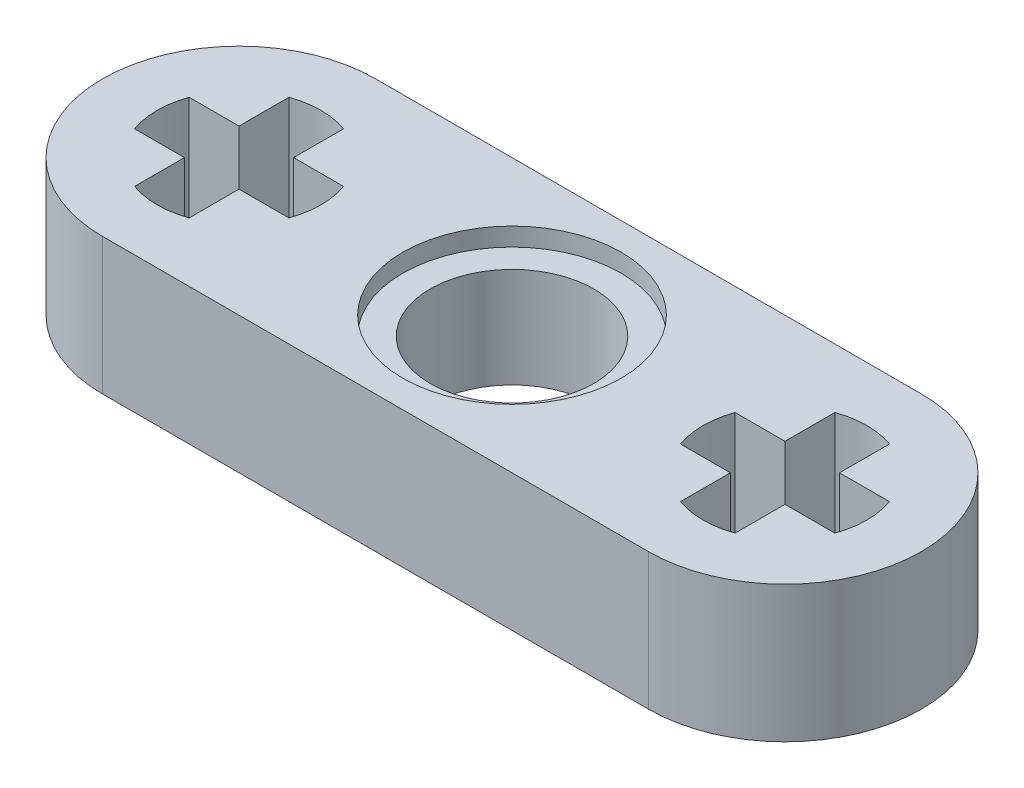
ISO-10303-21;
HEADER;
FILE_DESCRIPTION(('STEP AP214'),'2;1');
FILE_NAME('part.step','',(''),(''),'','','');
FILE_SCHEMA(('AUTOMOTIVE_DESIGN { 1 0 10303 214 1 1 1 1 }'));
ENDSEC;
DATA;
#1=APPLICATION_CONTEXT('core data for automotive mechanical design processes');
#2=APPLICATION_PROTOCOL_DEFINITION('international standard','automotive_design',2000,#1);
#3=PRODUCT_CONTEXT('',#1,'mechanical');
#4=PRODUCT('Part','Part','',(#3));
#5=PRODUCT_RELATED_PRODUCT_CATEGORY('part','',(#4));
#6=PRODUCT_DEFINITION_FORMATION('','',#4);
#7=PRODUCT_DEFINITION_CONTEXT('part definition',#1,'design');
#8=PRODUCT_DEFINITION('design','',#6,#7);
#9=PRODUCT_DEFINITION_SHAPE('','',#8);
#10=(LENGTH_UNIT() NAMED_UNIT(*) SI_UNIT(.MILLI.,.METRE.));
#11=(NAMED_UNIT(*) PLANE_ANGLE_UNIT() SI_UNIT($,.RADIAN.));
#12=(NAMED_UNIT(*) SI_UNIT($,.STERADIAN.) SOLID_ANGLE_UNIT());
#13=UNCERTAINTY_MEASURE_WITH_UNIT(LENGTH_MEASURE(1.E-05),#10,'distance_accuracy_value','');
#14=(GEOMETRIC_REPRESENTATION_CONTEXT(3) GLOBAL_UNCERTAINTY_ASSIGNED_CONTEXT((#13)) GLOBAL_UNIT_ASSIGNED_CONTEXT((#10,
#11,#12)) REPRESENTATION_CONTEXT('',''));
#15=CARTESIAN_POINT('',(0.,0.,0.));
#16=DIRECTION('',(0.,0.,1.));
#17=DIRECTION('',(1.,0.,0.));
#18=AXIS2_PLACEMENT_3D('',#15,#16,#17);
#19=CARTESIAN_POINT('',(5.,1.25,0.));
#20=DIRECTION('',(0.,-1.,0.));
#21=DIRECTION('',(0.,0.,-1.));
#22=AXIS2_PLACEMENT_3D('',#19,#20,#21);
#23=CYLINDRICAL_SURFACE('',#22,1.5);
#24=CARTESIAN_POINT('',(5.,0.,0.));
#25=DIRECTION('',(0.,1.,0.));
#26=DIRECTION('',(0.,0.,1.));
#27=AXIS2_PLACEMENT_3D('',#24,#25,#26);
#28=CIRCLE('',#27,1.5);
#29=CARTESIAN_POINT('',(4.5,0.,1.4142135623731));
#30=VERTEX_POINT('',#29);
#31=CARTESIAN_POINT('',(5.5,0.,1.4142135623731));
#32=VERTEX_POINT('',#31);
#33=EDGE_CURVE('E371',#30,#32,#28,.T.);
#34=ORIENTED_EDGE('',*,*,#33,.F.);
#35=DIRECTION('',(0.,-1.,0.));
#36=VECTOR('',#35,1.);
#37=CARTESIAN_POINT('',(4.5,1.25,1.4142135623731));
#38=LINE('',#37,#36);
#39=CARTESIAN_POINT('',(4.5,2.5,1.4142135623731));
#40=VERTEX_POINT('',#39);
#41=EDGE_CURVE('E11',#40,#30,#38,.T.);
#42=ORIENTED_EDGE('',*,*,#41,.F.);
#43=CARTESIAN_POINT('',(5.,2.5,0.));
#44=DIRECTION('',(0.,1.,0.));
#45=DIRECTION('',(0.,0.,1.));
#46=AXIS2_PLACEMENT_3D('',#43,#44,#45);
#47=CIRCLE('',#46,1.5);
#48=CARTESIAN_POINT('',(5.5,2.5,1.4142135623731));
#49=VERTEX_POINT('',#48);
#50=EDGE_CURVE('E291',#40,#49,#47,.T.);
#51=ORIENTED_EDGE('',*,*,#50,.T.);
#52=DIRECTION('',(0.,-1.,0.));
#53=VECTOR('',#52,1.);
#54=CARTESIAN_POINT('',(5.5,1.25,1.4142135623731));
#55=LINE('',#54,#53);
#56=EDGE_CURVE('E52',#49,#32,#55,.T.);
#57=ORIENTED_EDGE('',*,*,#56,.T.);
#58=EDGE_LOOP('',(#34,#42,#51,#57));
#59=FACE_BOUND('',#58,.T.);
#60=ADVANCED_FACE('F35',(#59),#23,.F.);
#61=CARTESIAN_POINT('',(4.5,1.25,0.));
#62=DIRECTION('',(-1.,0.,0.));
#63=DIRECTION('',(0.,0.,1.));
#64=AXIS2_PLACEMENT_3D('',#61,#62,#63);
#65=PLANE('',#64);
#66=DIRECTION('',(0.,0.,-1.));
#67=VECTOR('',#66,1.);
#68=CARTESIAN_POINT('',(4.5,0.,0.));
#69=LINE('',#68,#67);
#70=CARTESIAN_POINT('',(4.5,0.,0.5));
#71=VERTEX_POINT('',#70);
#72=EDGE_CURVE('E373',#30,#71,#69,.T.);
#73=ORIENTED_EDGE('',*,*,#72,.T.);
#74=DIRECTION('',(0.,-1.,0.));
#75=VECTOR('',#74,1.);
#76=CARTESIAN_POINT('',(4.5,1.25,0.5));
#77=LINE('',#76,#75);
#78=CARTESIAN_POINT('',(4.5,2.5,0.5));
#79=VERTEX_POINT('',#78);
#80=EDGE_CURVE('E44',#79,#71,#77,.T.);
#81=ORIENTED_EDGE('',*,*,#80,.F.);
#82=DIRECTION('',(0.,0.,-1.));
#83=VECTOR('',#82,1.);
#84=CARTESIAN_POINT('',(4.5,2.5,0.));
#85=LINE('',#84,#83);
#86=EDGE_CURVE('E316',#40,#79,#85,.T.);
#87=ORIENTED_EDGE('',*,*,#86,.F.);
#88=ORIENTED_EDGE('',*,*,#41,.T.);
#89=EDGE_LOOP('',(#73,#81,#87,#88));
#90=FACE_BOUND('',#89,.T.);
#91=ADVANCED_FACE('F496',(#90),#65,.F.);
#92=CARTESIAN_POINT('',(0.,1.25,0.5));
#93=DIRECTION('',(0.,0.,-1.));
#94=DIRECTION('',(-1.,0.,0.));
#95=AXIS2_PLACEMENT_3D('',#92,#93,#94);
#96=PLANE('',#95);
#97=DIRECTION('',(1.,0.,0.));
#98=VECTOR('',#97,1.);
#99=CARTESIAN_POINT('',(0.,0.,0.5));
#100=LINE('',#99,#98);
#101=CARTESIAN_POINT('',(3.58578643762691,0.,0.5));
#102=VERTEX_POINT('',#101);
#103=EDGE_CURVE('E378',#102,#71,#100,.T.);
#104=ORIENTED_EDGE('',*,*,#103,.F.);
#105=DIRECTION('',(0.,-1.,0.));
#106=VECTOR('',#105,1.);
#107=CARTESIAN_POINT('',(3.58578643762691,1.25,0.5));
#108=LINE('',#107,#106);
#109=CARTESIAN_POINT('',(3.58578643762691,2.5,0.5));
#110=VERTEX_POINT('',#109);
#111=EDGE_CURVE('E417',#110,#102,#108,.T.);
#112=ORIENTED_EDGE('',*,*,#111,.F.);
#113=DIRECTION('',(1.,0.,0.));
#114=VECTOR('',#113,1.);
#115=CARTESIAN_POINT('',(0.,2.5,0.5));
#116=LINE('',#115,#114);
#117=EDGE_CURVE('E313',#110,#79,#116,.T.);
#118=ORIENTED_EDGE('',*,*,#117,.T.);
#119=ORIENTED_EDGE('',*,*,#80,.T.);
#120=EDGE_LOOP('',(#104,#112,#118,#119));
#121=FACE_BOUND('',#120,.T.);
#122=ADVANCED_FACE('F503',(#121),#96,.T.);
#123=CARTESIAN_POINT('',(3.58578643762691,0.,-0.5));
#124=VERTEX_POINT('',#123);
#125=EDGE_CURVE('E375',#124,#102,#28,.T.);
#126=ORIENTED_EDGE('',*,*,#125,.F.);
#127=DIRECTION('',(0.,-1.,0.));
#128=VECTOR('',#127,1.);
#129=CARTESIAN_POINT('',(3.58578643762691,1.25,-0.5));
#130=LINE('',#129,#128);
#131=CARTESIAN_POINT('',(3.58578643762691,2.5,-0.5));
#132=VERTEX_POINT('',#131);
#133=EDGE_CURVE('E415',#132,#124,#130,.T.);
#134=ORIENTED_EDGE('',*,*,#133,.F.);
#135=EDGE_CURVE('E294',#132,#110,#47,.T.);
#136=ORIENTED_EDGE('',*,*,#135,.T.);
#137=ORIENTED_EDGE('',*,*,#111,.T.);
#138=EDGE_LOOP('',(#126,#134,#136,#137));
#139=FACE_BOUND('',#138,.T.);
#140=ADVANCED_FACE('F498',(#139),#23,.F.);
#141=CARTESIAN_POINT('',(0.,1.25,-0.5));
#142=DIRECTION('',(0.,0.,-1.));
#143=DIRECTION('',(-1.,0.,0.));
#144=AXIS2_PLACEMENT_3D('',#141,#142,#143);
#145=PLANE('',#144);
#146=DIRECTION('',(1.,0.,0.));
#147=VECTOR('',#146,1.);
#148=CARTESIAN_POINT('',(0.,0.,-0.5));
#149=LINE('',#148,#147);
#150=CARTESIAN_POINT('',(4.5,0.,-0.5));
#151=VERTEX_POINT('',#150);
#152=EDGE_CURVE('E381',#124,#151,#149,.T.);
#153=ORIENTED_EDGE('',*,*,#152,.T.);
#154=DIRECTION('',(0.,-1.,0.));
#155=VECTOR('',#154,1.);
#156=CARTESIAN_POINT('',(4.5,1.25,-0.5));
#157=LINE('',#156,#155);
#158=CARTESIAN_POINT('',(4.5,2.5,-0.5));
#159=VERTEX_POINT('',#158);
#160=EDGE_CURVE('E412',#159,#151,#157,.T.);
#161=ORIENTED_EDGE('',*,*,#160,.F.);
#162=DIRECTION('',(1.,0.,0.));
#163=VECTOR('',#162,1.);
#164=CARTESIAN_POINT('',(0.,2.5,-0.5));
#165=LINE('',#164,#163);
#166=EDGE_CURVE('E310',#132,#159,#165,.T.);
#167=ORIENTED_EDGE('',*,*,#166,.F.);
#168=ORIENTED_EDGE('',*,*,#133,.T.);
#169=EDGE_LOOP('',(#153,#161,#167,#168));
#170=FACE_BOUND('',#169,.T.);
#171=ADVANCED_FACE('F509',(#170),#145,.F.);
#172=CARTESIAN_POINT('',(4.5,1.25,0.));
#173=DIRECTION('',(-1.,0.,0.));
#174=DIRECTION('',(0.,0.,1.));
#175=AXIS2_PLACEMENT_3D('',#172,#173,#174);
#176=PLANE('',#175);
#177=DIRECTION('',(0.,0.,-1.));
#178=VECTOR('',#177,1.);
#179=CARTESIAN_POINT('',(4.5,0.,0.));
#180=LINE('',#179,#178);
#181=CARTESIAN_POINT('',(4.5,0.,-1.4142135623731));
#182=VERTEX_POINT('',#181);
#183=EDGE_CURVE('E384',#151,#182,#180,.T.);
#184=ORIENTED_EDGE('',*,*,#183,.T.);
#185=DIRECTION('',(0.,-1.,0.));
#186=VECTOR('',#185,1.);
#187=CARTESIAN_POINT('',(4.5,1.25,-1.4142135623731));
#188=LINE('',#187,#186);
#189=CARTESIAN_POINT('',(4.5,2.5,-1.4142135623731));
#190=VERTEX_POINT('',#189);
#191=EDGE_CURVE('E410',#190,#182,#188,.T.);
#192=ORIENTED_EDGE('',*,*,#191,.F.);
#193=DIRECTION('',(0.,0.,-1.));
#194=VECTOR('',#193,1.);
#195=CARTESIAN_POINT('',(4.5,2.5,0.));
#196=LINE('',#195,#194);
#197=EDGE_CURVE('E307',#159,#190,#196,.T.);
#198=ORIENTED_EDGE('',*,*,#197,.F.);
#199=ORIENTED_EDGE('',*,*,#160,.T.);
#200=EDGE_LOOP('',(#184,#192,#198,#199));
#201=FACE_BOUND('',#200,.T.);
#202=ADVANCED_FACE('F526',(#201),#176,.F.);
#203=CARTESIAN_POINT('',(5.5,0.,-1.4142135623731));
#204=VERTEX_POINT('',#203);
#205=EDGE_CURVE('E387',#204,#182,#28,.T.);
#206=ORIENTED_EDGE('',*,*,#205,.F.);
#207=DIRECTION('',(0.,-1.,0.));
#208=VECTOR('',#207,1.);
#209=CARTESIAN_POINT('',(5.5,1.25,-1.4142135623731));
#210=LINE('',#209,#208);
#211=CARTESIAN_POINT('',(5.5,2.5,-1.4142135623731));
#212=VERTEX_POINT('',#211);
#213=EDGE_CURVE('E408',#212,#204,#210,.T.);
#214=ORIENTED_EDGE('',*,*,#213,.F.);
#215=EDGE_CURVE('E306',#212,#190,#47,.T.);
#216=ORIENTED_EDGE('',*,*,#215,.T.);
#217=ORIENTED_EDGE('',*,*,#191,.T.);
#218=EDGE_LOOP('',(#206,#214,#216,#217));
#219=FACE_BOUND('',#218,.T.);
#220=ADVANCED_FACE('F511',(#219),#23,.F.);
#221=CARTESIAN_POINT('',(5.5,1.25,0.));
#222=DIRECTION('',(-1.,0.,0.));
#223=DIRECTION('',(0.,0.,1.));
#224=AXIS2_PLACEMENT_3D('',#221,#222,#223);
#225=PLANE('',#224);
#226=DIRECTION('',(0.,0.,-1.));
#227=VECTOR('',#226,1.);
#228=CARTESIAN_POINT('',(5.5,0.,0.));
#229=LINE('',#228,#227);
#230=CARTESIAN_POINT('',(5.5,0.,-0.5));
#231=VERTEX_POINT('',#230);
#232=EDGE_CURVE('E388',#231,#204,#229,.T.);
#233=ORIENTED_EDGE('',*,*,#232,.F.);
#234=DIRECTION('',(0.,-1.,0.));
#235=VECTOR('',#234,1.);
#236=CARTESIAN_POINT('',(5.5,1.25,-0.5));
#237=LINE('',#236,#235);
#238=CARTESIAN_POINT('',(5.5,2.5,-0.5));
#239=VERTEX_POINT('',#238);
#240=EDGE_CURVE('E406',#239,#231,#237,.T.);
#241=ORIENTED_EDGE('',*,*,#240,.F.);
#242=DIRECTION('',(0.,0.,-1.));
#243=VECTOR('',#242,1.);
#244=CARTESIAN_POINT('',(5.5,2.5,0.));
#245=LINE('',#244,#243);
#246=EDGE_CURVE('E303',#239,#212,#245,.T.);
#247=ORIENTED_EDGE('',*,*,#246,.T.);
#248=ORIENTED_EDGE('',*,*,#213,.T.);
#249=EDGE_LOOP('',(#233,#241,#247,#248));
#250=FACE_BOUND('',#249,.T.);
#251=ADVANCED_FACE('F522',(#250),#225,.T.);
#252=CARTESIAN_POINT('',(0.,1.25,-0.5));
#253=DIRECTION('',(0.,0.,-1.));
#254=DIRECTION('',(-1.,0.,0.));
#255=AXIS2_PLACEMENT_3D('',#252,#253,#254);
#256=PLANE('',#255);
#257=DIRECTION('',(1.,0.,0.));
#258=VECTOR('',#257,1.);
#259=CARTESIAN_POINT('',(0.,0.,-0.5));
#260=LINE('',#259,#258);
#261=CARTESIAN_POINT('',(6.4142135623731,0.,-0.5));
#262=VERTEX_POINT('',#261);
#263=EDGE_CURVE('E391',#231,#262,#260,.T.);
#264=ORIENTED_EDGE('',*,*,#263,.T.);
#265=DIRECTION('',(0.,-1.,0.));
#266=VECTOR('',#265,1.);
#267=CARTESIAN_POINT('',(6.4142135623731,1.25,-0.5));
#268=LINE('',#267,#266);
#269=CARTESIAN_POINT('',(6.4142135623731,2.5,-0.5));
#270=VERTEX_POINT('',#269);
#271=EDGE_CURVE('E404',#270,#262,#268,.T.);
#272=ORIENTED_EDGE('',*,*,#271,.F.);
#273=DIRECTION('',(1.,0.,0.));
#274=VECTOR('',#273,1.);
#275=CARTESIAN_POINT('',(0.,2.5,-0.5));
#276=LINE('',#275,#274);
#277=EDGE_CURVE('E300',#239,#270,#276,.T.);
#278=ORIENTED_EDGE('',*,*,#277,.F.);
#279=ORIENTED_EDGE('',*,*,#240,.T.);
#280=EDGE_LOOP('',(#264,#272,#278,#279));
#281=FACE_BOUND('',#280,.T.);
#282=ADVANCED_FACE('F514',(#281),#256,.F.);
#283=CARTESIAN_POINT('',(6.4142135623731,0.,0.5));
#284=VERTEX_POINT('',#283);
#285=EDGE_CURVE('E374',#284,#262,#28,.T.);
#286=ORIENTED_EDGE('',*,*,#285,.F.);
#287=DIRECTION('',(0.,-1.,0.));
#288=VECTOR('',#287,1.);
#289=CARTESIAN_POINT('',(6.4142135623731,1.25,0.5));
#290=LINE('',#289,#288);
#291=CARTESIAN_POINT('',(6.4142135623731,2.5,0.5));
#292=VERTEX_POINT('',#291);
#293=EDGE_CURVE('E402',#292,#284,#290,.T.);
#294=ORIENTED_EDGE('',*,*,#293,.F.);
#295=EDGE_CURVE('E295',#292,#270,#47,.T.);
#296=ORIENTED_EDGE('',*,*,#295,.T.);
#297=ORIENTED_EDGE('',*,*,#271,.T.);
#298=EDGE_LOOP('',(#286,#294,#296,#297));
#299=FACE_BOUND('',#298,.T.);
#300=ADVANCED_FACE('F499',(#299),#23,.F.);
#301=CARTESIAN_POINT('',(0.,1.25,0.5));
#302=DIRECTION('',(0.,0.,-1.));
#303=DIRECTION('',(-1.,0.,0.));
#304=AXIS2_PLACEMENT_3D('',#301,#302,#303);
#305=PLANE('',#304);
#306=DIRECTION('',(1.,0.,0.));
#307=VECTOR('',#306,1.);
#308=CARTESIAN_POINT('',(0.,0.,0.5));
#309=LINE('',#308,#307);
#310=CARTESIAN_POINT('',(5.5,0.,0.5));
#311=VERTEX_POINT('',#310);
#312=EDGE_CURVE('E394',#311,#284,#309,.T.);
#313=ORIENTED_EDGE('',*,*,#312,.F.);
#314=DIRECTION('',(0.,-1.,0.));
#315=VECTOR('',#314,1.);
#316=CARTESIAN_POINT('',(5.5,1.25,0.5));
#317=LINE('',#316,#315);
#318=CARTESIAN_POINT('',(5.5,2.5,0.5));
#319=VERTEX_POINT('',#318);
#320=EDGE_CURVE('E60',#319,#311,#317,.T.);
#321=ORIENTED_EDGE('',*,*,#320,.F.);
#322=DIRECTION('',(1.,0.,0.));
#323=VECTOR('',#322,1.);
#324=CARTESIAN_POINT('',(0.,2.5,0.5));
#325=LINE('',#324,#323);
#326=EDGE_CURVE('E297',#319,#292,#325,.T.);
#327=ORIENTED_EDGE('',*,*,#326,.T.);
#328=ORIENTED_EDGE('',*,*,#293,.T.);
#329=EDGE_LOOP('',(#313,#321,#327,#328));
#330=FACE_BOUND('',#329,.T.);
#331=ADVANCED_FACE('F513',(#330),#305,.T.);
#332=CARTESIAN_POINT('',(-5.,1.25,0.));
#333=DIRECTION('',(0.,-1.,0.));
#334=DIRECTION('',(0.,0.,-1.));
#335=AXIS2_PLACEMENT_3D('',#332,#333,#334);
#336=CYLINDRICAL_SURFACE('',#335,2.5);
#337=CARTESIAN_POINT('',(-5.,0.,0.));
#338=DIRECTION('',(0.,1.,0.));
#339=DIRECTION('',(0.,0.,1.));
#340=AXIS2_PLACEMENT_3D('',#337,#338,#339);
#341=CIRCLE('',#340,2.5);
#342=CARTESIAN_POINT('',(-5.,0.,-2.5));
#343=VERTEX_POINT('',#342);
#344=CARTESIAN_POINT('',(-5.,0.,2.5));
#345=VERTEX_POINT('',#344);
#346=EDGE_CURVE('E360',#343,#345,#341,.T.);
#347=ORIENTED_EDGE('',*,*,#346,.T.);
#348=DIRECTION('',(0.,-1.,0.));
#349=VECTOR('',#348,1.);
#350=CARTESIAN_POINT('',(-5.,1.25,2.5));
#351=LINE('',#350,#349);
#352=CARTESIAN_POINT('',(-5.,2.5,2.5));
#353=VERTEX_POINT('',#352);
#354=EDGE_CURVE('E400',#353,#345,#351,.T.);
#355=ORIENTED_EDGE('',*,*,#354,.F.);
#356=CARTESIAN_POINT('',(-5.,2.5,0.));
#357=DIRECTION('',(0.,1.,0.));
#358=DIRECTION('',(0.,0.,1.));
#359=AXIS2_PLACEMENT_3D('',#356,#357,#358);
#360=CIRCLE('',#359,2.5);
#361=CARTESIAN_POINT('',(-5.,2.5,-2.5));
#362=VERTEX_POINT('',#361);
#363=EDGE_CURVE('E279',#362,#353,#360,.T.);
#364=ORIENTED_EDGE('',*,*,#363,.F.);
#365=DIRECTION('',(0.,-1.,0.));
#366=VECTOR('',#365,1.);
#367=CARTESIAN_POINT('',(-5.,1.25,-2.5));
#368=LINE('',#367,#366);
#369=EDGE_CURVE('E420',#362,#343,#368,.T.);
#370=ORIENTED_EDGE('',*,*,#369,.T.);
#371=EDGE_LOOP('',(#347,#355,#364,#370));
#372=FACE_BOUND('',#371,.T.);
#373=ADVANCED_FACE('F520',(#372),#336,.T.);
#374=CARTESIAN_POINT('',(0.,1.25,2.5));
#375=DIRECTION('',(0.,0.,-1.));
#376=DIRECTION('',(-1.,0.,0.));
#377=AXIS2_PLACEMENT_3D('',#374,#375,#376);
#378=PLANE('',#377);
#379=DIRECTION('',(1.,0.,0.));
#380=VECTOR('',#379,1.);
#381=CARTESIAN_POINT('',(0.,0.,2.5));
#382=LINE('',#381,#380);
#383=CARTESIAN_POINT('',(5.,0.,2.5));
#384=VERTEX_POINT('',#383);
#385=EDGE_CURVE('E363',#345,#384,#382,.T.);
#386=ORIENTED_EDGE('',*,*,#385,.T.);
#387=DIRECTION('',(0.,-1.,0.));
#388=VECTOR('',#387,1.);
#389=CARTESIAN_POINT('',(5.,1.25,2.5));
#390=LINE('',#389,#388);
#391=CARTESIAN_POINT('',(5.,2.5,2.5));
#392=VERTEX_POINT('',#391);
#393=EDGE_CURVE('E424',#392,#384,#390,.T.);
#394=ORIENTED_EDGE('',*,*,#393,.F.);
#395=DIRECTION('',(1.,0.,0.));
#396=VECTOR('',#395,1.);
#397=CARTESIAN_POINT('',(0.,2.5,2.5));
#398=LINE('',#397,#396);
#399=EDGE_CURVE('E288',#353,#392,#398,.T.);
#400=ORIENTED_EDGE('',*,*,#399,.F.);
#401=ORIENTED_EDGE('',*,*,#354,.T.);
#402=EDGE_LOOP('',(#386,#394,#400,#401));
#403=FACE_BOUND('',#402,.T.);
#404=ADVANCED_FACE('F580',(#403),#378,.F.);
#405=CARTESIAN_POINT('',(5.,1.25,0.));
#406=DIRECTION('',(0.,-1.,0.));
#407=DIRECTION('',(0.,0.,-1.));
#408=AXIS2_PLACEMENT_3D('',#405,#406,#407);
#409=CYLINDRICAL_SURFACE('',#408,2.5);
#410=CARTESIAN_POINT('',(5.,0.,0.));
#411=DIRECTION('',(0.,1.,0.));
#412=DIRECTION('',(0.,0.,1.));
#413=AXIS2_PLACEMENT_3D('',#410,#411,#412);
#414=CIRCLE('',#413,2.5);
#415=CARTESIAN_POINT('',(5.,0.,-2.5));
#416=VERTEX_POINT('',#415);
#417=EDGE_CURVE('E365',#384,#416,#414,.T.);
#418=ORIENTED_EDGE('',*,*,#417,.T.);
#419=DIRECTION('',(0.,-1.,0.));
#420=VECTOR('',#419,1.);
#421=CARTESIAN_POINT('',(5.,1.25,-2.5));
#422=LINE('',#421,#420);
#423=CARTESIAN_POINT('',(5.,2.5,-2.5));
#424=VERTEX_POINT('',#423);
#425=EDGE_CURVE('E422',#424,#416,#422,.T.);
#426=ORIENTED_EDGE('',*,*,#425,.F.);
#427=CARTESIAN_POINT('',(5.,2.5,0.));
#428=DIRECTION('',(0.,1.,0.));
#429=DIRECTION('',(0.,0.,1.));
#430=AXIS2_PLACEMENT_3D('',#427,#428,#429);
#431=CIRCLE('',#430,2.5);
#432=EDGE_CURVE('E285',#392,#424,#431,.T.);
#433=ORIENTED_EDGE('',*,*,#432,.F.);
#434=ORIENTED_EDGE('',*,*,#393,.T.);
#435=EDGE_LOOP('',(#418,#426,#433,#434));
#436=FACE_BOUND('',#435,.T.);
#437=ADVANCED_FACE('F577',(#436),#409,.T.);
#438=CARTESIAN_POINT('',(-5.,1.25,0.));
#439=DIRECTION('',(0.,-1.,0.));
#440=DIRECTION('',(0.,0.,-1.));
#441=AXIS2_PLACEMENT_3D('',#438,#439,#440);
#442=CYLINDRICAL_SURFACE('',#441,1.5);
#443=CARTESIAN_POINT('',(-5.,0.,0.));
#444=DIRECTION('',(0.,1.,0.));
#445=DIRECTION('',(0.,0.,1.));
#446=AXIS2_PLACEMENT_3D('',#443,#444,#445);
#447=CIRCLE('',#446,1.5);
#448=CARTESIAN_POINT('',(-3.5857864376269,0.,0.5));
#449=VERTEX_POINT('',#448);
#450=CARTESIAN_POINT('',(-3.5857864376269,0.,-0.5));
#451=VERTEX_POINT('',#450);
#452=EDGE_CURVE('E326',#449,#451,#447,.T.);
#453=ORIENTED_EDGE('',*,*,#452,.F.);
#454=DIRECTION('',(0.,-1.,0.));
#455=VECTOR('',#454,1.);
#456=CARTESIAN_POINT('',(-3.5857864376269,1.25,0.5));
#457=LINE('',#456,#455);
#458=CARTESIAN_POINT('',(-3.5857864376269,2.5,0.5));
#459=VERTEX_POINT('',#458);
#460=EDGE_CURVE('E39',#459,#449,#457,.T.);
#461=ORIENTED_EDGE('',*,*,#460,.F.);
#462=CARTESIAN_POINT('',(-5.,2.5,0.));
#463=DIRECTION('',(0.,1.,0.));
#464=DIRECTION('',(0.,0.,1.));
#465=AXIS2_PLACEMENT_3D('',#462,#463,#464);
#466=CIRCLE('',#465,1.5);
#467=CARTESIAN_POINT('',(-3.5857864376269,2.5,-0.5));
#468=VERTEX_POINT('',#467);
#469=EDGE_CURVE('E237',#459,#468,#466,.T.);
#470=ORIENTED_EDGE('',*,*,#469,.T.);
#471=DIRECTION('',(0.,-1.,0.));
#472=VECTOR('',#471,1.);
#473=CARTESIAN_POINT('',(-3.5857864376269,1.25,-0.5));
#474=LINE('',#473,#472);
#475=EDGE_CURVE('E223',#468,#451,#474,.T.);
#476=ORIENTED_EDGE('',*,*,#475,.T.);
#477=EDGE_LOOP('',(#453,#461,#470,#476));
#478=FACE_BOUND('',#477,.T.);
#479=ADVANCED_FACE('F37',(#478),#442,.F.);
#480=CARTESIAN_POINT('',(0.,1.25,0.5));
#481=DIRECTION('',(0.,0.,-1.));
#482=DIRECTION('',(-1.,0.,0.));
#483=AXIS2_PLACEMENT_3D('',#480,#481,#482);
#484=PLANE('',#483);
#485=DIRECTION('',(1.,0.,0.));
#486=VECTOR('',#485,1.);
#487=CARTESIAN_POINT('',(0.,0.,0.5));
#488=LINE('',#487,#486);
#489=CARTESIAN_POINT('',(-4.5,0.,0.5));
#490=VERTEX_POINT('',#489);
#491=EDGE_CURVE('E330',#490,#449,#488,.T.);
#492=ORIENTED_EDGE('',*,*,#491,.F.);
#493=DIRECTION('',(0.,-1.,0.));
#494=VECTOR('',#493,1.);
#495=CARTESIAN_POINT('',(-4.5,1.25,0.5));
#496=LINE('',#495,#494);
#497=CARTESIAN_POINT('',(-4.5,2.5,0.5));
#498=VERTEX_POINT('',#497);
#499=EDGE_CURVE('E446',#498,#490,#496,.T.);
#500=ORIENTED_EDGE('',*,*,#499,.F.);
#501=DIRECTION('',(1.,0.,0.));
#502=VECTOR('',#501,1.);
#503=CARTESIAN_POINT('',(0.,2.5,0.5));
#504=LINE('',#503,#502);
#505=EDGE_CURVE('E277',#498,#459,#504,.T.);
#506=ORIENTED_EDGE('',*,*,#505,.T.);
#507=ORIENTED_EDGE('',*,*,#460,.T.);
#508=EDGE_LOOP('',(#492,#500,#506,#507));
#509=FACE_BOUND('',#508,.T.);
#510=ADVANCED_FACE('F451',(#509),#484,.T.);
#511=CARTESIAN_POINT('',(-4.5,1.25,0.));
#512=DIRECTION('',(-1.,0.,0.));
#513=DIRECTION('',(0.,0.,1.));
#514=AXIS2_PLACEMENT_3D('',#511,#512,#513);
#515=PLANE('',#514);
#516=DIRECTION('',(0.,0.,-1.));
#517=VECTOR('',#516,1.);
#518=CARTESIAN_POINT('',(-4.5,0.,0.));
#519=LINE('',#518,#517);
#520=CARTESIAN_POINT('',(-4.5,0.,1.4142135623731));
#521=VERTEX_POINT('',#520);
#522=EDGE_CURVE('E333',#521,#490,#519,.T.);
#523=ORIENTED_EDGE('',*,*,#522,.F.);
#524=DIRECTION('',(0.,-1.,0.));
#525=VECTOR('',#524,1.);
#526=CARTESIAN_POINT('',(-4.5,1.25,1.4142135623731));
#527=LINE('',#526,#525);
#528=CARTESIAN_POINT('',(-4.5,2.5,1.4142135623731));
#529=VERTEX_POINT('',#528);
#530=EDGE_CURVE('E445',#529,#521,#527,.T.);
#531=ORIENTED_EDGE('',*,*,#530,.F.);
#532=DIRECTION('',(0.,0.,-1.));
#533=VECTOR('',#532,1.);
#534=CARTESIAN_POINT('',(-4.5,2.5,0.));
#535=LINE('',#534,#533);
#536=EDGE_CURVE('E274',#529,#498,#535,.T.);
#537=ORIENTED_EDGE('',*,*,#536,.T.);
#538=ORIENTED_EDGE('',*,*,#499,.T.);
#539=EDGE_LOOP('',(#523,#531,#537,#538));
#540=FACE_BOUND('',#539,.T.);
#541=ADVANCED_FACE('F457',(#540),#515,.T.);
#542=CARTESIAN_POINT('',(-5.,1.25,0.));
#543=DIRECTION('',(0.,-1.,0.));
#544=DIRECTION('',(0.,0.,-1.));
#545=AXIS2_PLACEMENT_3D('',#542,#543,#544);
#546=CYLINDRICAL_SURFACE('',#545,1.5);
#547=CARTESIAN_POINT('',(-5.,0.,0.));
#548=DIRECTION('',(0.,1.,0.));
#549=DIRECTION('',(0.,0.,1.));
#550=AXIS2_PLACEMENT_3D('',#547,#548,#549);
#551=CIRCLE('',#550,1.5);
#552=CARTESIAN_POINT('',(-5.5,0.,1.4142135623731));
#553=VERTEX_POINT('',#552);
#554=EDGE_CURVE('E336',#553,#521,#551,.T.);
#555=ORIENTED_EDGE('',*,*,#554,.F.);
#556=DIRECTION('',(0.,-1.,0.));
#557=VECTOR('',#556,1.);
#558=CARTESIAN_POINT('',(-5.5,1.25,1.4142135623731));
#559=LINE('',#558,#557);
#560=CARTESIAN_POINT('',(-5.5,2.5,1.4142135623731));
#561=VERTEX_POINT('',#560);
#562=EDGE_CURVE('E443',#561,#553,#559,.T.);
#563=ORIENTED_EDGE('',*,*,#562,.F.);
#564=CARTESIAN_POINT('',(-5.,2.5,0.));
#565=DIRECTION('',(0.,1.,0.));
#566=DIRECTION('',(0.,0.,1.));
#567=AXIS2_PLACEMENT_3D('',#564,#565,#566);
#568=CIRCLE('',#567,1.5);
#569=EDGE_CURVE('E271',#561,#529,#568,.T.);
#570=ORIENTED_EDGE('',*,*,#569,.T.);
#571=ORIENTED_EDGE('',*,*,#530,.T.);
#572=EDGE_LOOP('',(#555,#563,#570,#571));
#573=FACE_BOUND('',#572,.T.);
#574=ADVANCED_FACE('F461',(#573),#546,.F.);
#575=CARTESIAN_POINT('',(-5.5,1.25,0.));
#576=DIRECTION('',(-1.,0.,0.));
#577=DIRECTION('',(0.,0.,1.));
#578=AXIS2_PLACEMENT_3D('',#575,#576,#577);
#579=PLANE('',#578);
#580=DIRECTION('',(0.,0.,-1.));
#581=VECTOR('',#580,1.);
#582=CARTESIAN_POINT('',(-5.5,0.,0.));
#583=LINE('',#582,#581);
#584=CARTESIAN_POINT('',(-5.5,0.,0.5));
#585=VERTEX_POINT('',#584);
#586=EDGE_CURVE('E339',#553,#585,#583,.T.);
#587=ORIENTED_EDGE('',*,*,#586,.T.);
#588=DIRECTION('',(0.,-1.,0.));
#589=VECTOR('',#588,1.);
#590=CARTESIAN_POINT('',(-5.5,1.25,0.5));
#591=LINE('',#590,#589);
#592=CARTESIAN_POINT('',(-5.5,2.5,0.5));
#593=VERTEX_POINT('',#592);
#594=EDGE_CURVE('E441',#593,#585,#591,.T.);
#595=ORIENTED_EDGE('',*,*,#594,.F.);
#596=DIRECTION('',(0.,0.,-1.));
#597=VECTOR('',#596,1.);
#598=CARTESIAN_POINT('',(-5.5,2.5,0.));
#599=LINE('',#598,#597);
#600=EDGE_CURVE('E268',#561,#593,#599,.T.);
#601=ORIENTED_EDGE('',*,*,#600,.F.);
#602=ORIENTED_EDGE('',*,*,#562,.T.);
#603=EDGE_LOOP('',(#587,#595,#601,#602));
#604=FACE_BOUND('',#603,.T.);
#605=ADVANCED_FACE('F465',(#604),#579,.F.);
#606=CARTESIAN_POINT('',(0.,1.25,0.5));
#607=DIRECTION('',(0.,0.,-1.));
#608=DIRECTION('',(-1.,0.,0.));
#609=AXIS2_PLACEMENT_3D('',#606,#607,#608);
#610=PLANE('',#609);
#611=DIRECTION('',(1.,0.,0.));
#612=VECTOR('',#611,1.);
#613=CARTESIAN_POINT('',(0.,0.,0.5));
#614=LINE('',#613,#612);
#615=CARTESIAN_POINT('',(-6.41421356237309,0.,0.5));
#616=VERTEX_POINT('',#615);
#617=EDGE_CURVE('E342',#616,#585,#614,.T.);
#618=ORIENTED_EDGE('',*,*,#617,.F.);
#619=DIRECTION('',(0.,-1.,0.));
#620=VECTOR('',#619,1.);
#621=CARTESIAN_POINT('',(-6.41421356237309,1.25,0.5));
#622=LINE('',#621,#620);
#623=CARTESIAN_POINT('',(-6.41421356237309,2.5,0.5));
#624=VERTEX_POINT('',#623);
#625=EDGE_CURVE('E439',#624,#616,#622,.T.);
#626=ORIENTED_EDGE('',*,*,#625,.F.);
#627=DIRECTION('',(1.,0.,0.));
#628=VECTOR('',#627,1.);
#629=CARTESIAN_POINT('',(0.,2.5,0.5));
#630=LINE('',#629,#628);
#631=EDGE_CURVE('E265',#624,#593,#630,.T.);
#632=ORIENTED_EDGE('',*,*,#631,.T.);
#633=ORIENTED_EDGE('',*,*,#594,.T.);
#634=EDGE_LOOP('',(#618,#626,#632,#633));
#635=FACE_BOUND('',#634,.T.);
#636=ADVANCED_FACE('F468',(#635),#610,.T.);
#637=CARTESIAN_POINT('',(-5.,1.25,0.));
#638=DIRECTION('',(0.,-1.,0.));
#639=DIRECTION('',(0.,0.,-1.));
#640=AXIS2_PLACEMENT_3D('',#637,#638,#639);
#641=CYLINDRICAL_SURFACE('',#640,1.5);
#642=CARTESIAN_POINT('',(-5.,0.,0.));
#643=DIRECTION('',(0.,1.,0.));
#644=DIRECTION('',(0.,0.,1.));
#645=AXIS2_PLACEMENT_3D('',#642,#643,#644);
#646=CIRCLE('',#645,1.5);
#647=CARTESIAN_POINT('',(-6.41421356237309,0.,-0.5));
#648=VERTEX_POINT('',#647);
#649=EDGE_CURVE('E345',#648,#616,#646,.T.);
#650=ORIENTED_EDGE('',*,*,#649,.F.);
#651=DIRECTION('',(0.,-1.,0.));
#652=VECTOR('',#651,1.);
#653=CARTESIAN_POINT('',(-6.41421356237309,1.25,-0.5));
#654=LINE('',#653,#652);
#655=CARTESIAN_POINT('',(-6.41421356237309,2.5,-0.5));
#656=VERTEX_POINT('',#655);
#657=EDGE_CURVE('E437',#656,#648,#654,.T.);
#658=ORIENTED_EDGE('',*,*,#657,.F.);
#659=CARTESIAN_POINT('',(-5.,2.5,0.));
#660=DIRECTION('',(0.,1.,0.));
#661=DIRECTION('',(0.,0.,1.));
#662=AXIS2_PLACEMENT_3D('',#659,#660,#661);
#663=CIRCLE('',#662,1.5);
#664=EDGE_CURVE('E262',#656,#624,#663,.T.);
#665=ORIENTED_EDGE('',*,*,#664,.T.);
#666=ORIENTED_EDGE('',*,*,#625,.T.);
#667=EDGE_LOOP('',(#650,#658,#665,#666));
#668=FACE_BOUND('',#667,.T.);
#669=ADVANCED_FACE('F486',(#668),#641,.F.);
#670=CARTESIAN_POINT('',(0.,1.25,-0.5));
#671=DIRECTION('',(0.,0.,-1.));
#672=DIRECTION('',(-1.,0.,0.));
#673=AXIS2_PLACEMENT_3D('',#670,#671,#672);
#674=PLANE('',#673);
#675=DIRECTION('',(1.,0.,0.));
#676=VECTOR('',#675,1.);
#677=CARTESIAN_POINT('',(0.,0.,-0.5));
#678=LINE('',#677,#676);
#679=CARTESIAN_POINT('',(-5.5,0.,-0.5));
#680=VERTEX_POINT('',#679);
#681=EDGE_CURVE('E348',#648,#680,#678,.T.);
#682=ORIENTED_EDGE('',*,*,#681,.T.);
#683=DIRECTION('',(0.,-1.,0.));
#684=VECTOR('',#683,1.);
#685=CARTESIAN_POINT('',(-5.5,1.25,-0.5));
#686=LINE('',#685,#684);
#687=CARTESIAN_POINT('',(-5.5,2.5,-0.5));
#688=VERTEX_POINT('',#687);
#689=EDGE_CURVE('E434',#688,#680,#686,.T.);
#690=ORIENTED_EDGE('',*,*,#689,.F.);
#691=DIRECTION('',(1.,0.,0.));
#692=VECTOR('',#691,1.);
#693=CARTESIAN_POINT('',(0.,2.5,-0.5));
#694=LINE('',#693,#692);
#695=EDGE_CURVE('E259',#656,#688,#694,.T.);
#696=ORIENTED_EDGE('',*,*,#695,.F.);
#697=ORIENTED_EDGE('',*,*,#657,.T.);
#698=EDGE_LOOP('',(#682,#690,#696,#697));
#699=FACE_BOUND('',#698,.T.);
#700=ADVANCED_FACE('F473',(#699),#674,.F.);
#701=CARTESIAN_POINT('',(-5.5,1.25,0.));
#702=DIRECTION('',(-1.,0.,0.));
#703=DIRECTION('',(0.,0.,1.));
#704=AXIS2_PLACEMENT_3D('',#701,#702,#703);
#705=PLANE('',#704);
#706=DIRECTION('',(0.,0.,-1.));
#707=VECTOR('',#706,1.);
#708=CARTESIAN_POINT('',(-5.5,0.,0.));
#709=LINE('',#708,#707);
#710=CARTESIAN_POINT('',(-5.5,0.,-1.4142135623731));
#711=VERTEX_POINT('',#710);
#712=EDGE_CURVE('E350',#680,#711,#709,.T.);
#713=ORIENTED_EDGE('',*,*,#712,.T.);
#714=DIRECTION('',(0.,-1.,0.));
#715=VECTOR('',#714,1.);
#716=CARTESIAN_POINT('',(-5.5,1.25,-1.4142135623731));
#717=LINE('',#716,#715);
#718=CARTESIAN_POINT('',(-5.5,2.5,-1.4142135623731));
#719=VERTEX_POINT('',#718);
#720=EDGE_CURVE('E432',#719,#711,#717,.T.);
#721=ORIENTED_EDGE('',*,*,#720,.F.);
#722=DIRECTION('',(0.,0.,-1.));
#723=VECTOR('',#722,1.);
#724=CARTESIAN_POINT('',(-5.5,2.5,0.));
#725=LINE('',#724,#723);
#726=EDGE_CURVE('E256',#688,#719,#725,.T.);
#727=ORIENTED_EDGE('',*,*,#726,.F.);
#728=ORIENTED_EDGE('',*,*,#689,.T.);
#729=EDGE_LOOP('',(#713,#721,#727,#728));
#730=FACE_BOUND('',#729,.T.);
#731=ADVANCED_FACE('F478',(#730),#705,.F.);
#732=CARTESIAN_POINT('',(-5.,1.25,0.));
#733=DIRECTION('',(0.,-1.,0.));
#734=DIRECTION('',(0.,0.,-1.));
#735=AXIS2_PLACEMENT_3D('',#732,#733,#734);
#736=CYLINDRICAL_SURFACE('',#735,1.5);
#737=CARTESIAN_POINT('',(-5.,0.,0.));
#738=DIRECTION('',(0.,1.,0.));
#739=DIRECTION('',(0.,0.,1.));
#740=AXIS2_PLACEMENT_3D('',#737,#738,#739);
#741=CIRCLE('',#740,1.5);
#742=CARTESIAN_POINT('',(-4.5,0.,-1.4142135623731));
#743=VERTEX_POINT('',#742);
#744=EDGE_CURVE('E353',#743,#711,#741,.T.);
#745=ORIENTED_EDGE('',*,*,#744,.F.);
#746=DIRECTION('',(0.,-1.,0.));
#747=VECTOR('',#746,1.);
#748=CARTESIAN_POINT('',(-4.5,1.25,-1.4142135623731));
#749=LINE('',#748,#747);
#750=CARTESIAN_POINT('',(-4.5,2.5,-1.4142135623731));
#751=VERTEX_POINT('',#750);
#752=EDGE_CURVE('E430',#751,#743,#749,.T.);
#753=ORIENTED_EDGE('',*,*,#752,.F.);
#754=CARTESIAN_POINT('',(-5.,2.5,0.));
#755=DIRECTION('',(0.,1.,0.));
#756=DIRECTION('',(0.,0.,1.));
#757=AXIS2_PLACEMENT_3D('',#754,#755,#756);
#758=CIRCLE('',#757,1.5);
#759=EDGE_CURVE('E250',#751,#719,#758,.T.);
#760=ORIENTED_EDGE('',*,*,#759,.T.);
#761=ORIENTED_EDGE('',*,*,#720,.T.);
#762=EDGE_LOOP('',(#745,#753,#760,#761));
#763=FACE_BOUND('',#762,.T.);
#764=ADVANCED_FACE('F481',(#763),#736,.F.);
#765=CARTESIAN_POINT('',(-4.5,1.25,0.));
#766=DIRECTION('',(-1.,0.,0.));
#767=DIRECTION('',(0.,0.,1.));
#768=AXIS2_PLACEMENT_3D('',#765,#766,#767);
#769=PLANE('',#768);
#770=DIRECTION('',(0.,0.,-1.));
#771=VECTOR('',#770,1.);
#772=CARTESIAN_POINT('',(-4.5,0.,0.));
#773=LINE('',#772,#771);
#774=CARTESIAN_POINT('',(-4.5,0.,-0.5));
#775=VERTEX_POINT('',#774);
#776=EDGE_CURVE('E356',#775,#743,#773,.T.);
#777=ORIENTED_EDGE('',*,*,#776,.F.);
#778=DIRECTION('',(0.,-1.,0.));
#779=VECTOR('',#778,1.);
#780=CARTESIAN_POINT('',(-4.5,1.25,-0.5));
#781=LINE('',#780,#779);
#782=CARTESIAN_POINT('',(-4.5,2.5,-0.5));
#783=VERTEX_POINT('',#782);
#784=EDGE_CURVE('E233',#783,#775,#781,.T.);
#785=ORIENTED_EDGE('',*,*,#784,.F.);
#786=DIRECTION('',(0.,0.,-1.));
#787=VECTOR('',#786,1.);
#788=CARTESIAN_POINT('',(-4.5,2.5,0.));
#789=LINE('',#788,#787);
#790=EDGE_CURVE('E248',#783,#751,#789,.T.);
#791=ORIENTED_EDGE('',*,*,#790,.T.);
#792=ORIENTED_EDGE('',*,*,#752,.T.);
#793=EDGE_LOOP('',(#777,#785,#791,#792));
#794=FACE_BOUND('',#793,.T.);
#795=ADVANCED_FACE('F484',(#794),#769,.T.);
#796=CARTESIAN_POINT('',(0.,1.25,0.));
#797=DIRECTION('',(0.,-1.,0.));
#798=DIRECTION('',(0.,0.,-1.));
#799=AXIS2_PLACEMENT_3D('',#796,#797,#798);
#800=CYLINDRICAL_SURFACE('',#799,1.5);
#801=CARTESIAN_POINT('',(0.,2.16666666666667,0.));
#802=DIRECTION('',(0.,1.,0.));
#803=DIRECTION('',(0.,0.,1.));
#804=AXIS2_PLACEMENT_3D('',#801,#802,#803);
#805=CIRCLE('',#804,1.5);
#806=CARTESIAN_POINT('',(0.,2.16666666666667,1.5));
#807=VERTEX_POINT('',#806);
#808=EDGE_CURVE('E1050',#807,#807,#805,.T.);
#809=ORIENTED_EDGE('',*,*,#808,.T.);
#810=EDGE_LOOP('',(#809));
#811=FACE_BOUND('',#810,.T.);
#812=CARTESIAN_POINT('',(0.,0.333333333333333,0.));
#813=DIRECTION('',(0.,1.,0.));
#814=DIRECTION('',(0.,0.,1.));
#815=AXIS2_PLACEMENT_3D('',#812,#813,#814);
#816=CIRCLE('',#815,1.5);
#817=CARTESIAN_POINT('',(0.,0.333333333333333,1.5));
#818=VERTEX_POINT('',#817);
#819=EDGE_CURVE('E320',#818,#818,#816,.T.);
#820=ORIENTED_EDGE('',*,*,#819,.F.);
#821=EDGE_LOOP('',(#820));
#822=FACE_BOUND('',#821,.T.);
#823=ADVANCED_FACE('F569',(#811,#822),#800,.F.);
#824=CARTESIAN_POINT('',(0.,1.25,-2.5));
#825=DIRECTION('',(0.,0.,-1.));
#826=DIRECTION('',(-1.,0.,0.));
#827=AXIS2_PLACEMENT_3D('',#824,#825,#826);
#828=PLANE('',#827);
#829=DIRECTION('',(1.,0.,0.));
#830=VECTOR('',#829,1.);
#831=CARTESIAN_POINT('',(0.,0.,-2.5));
#832=LINE('',#831,#830);
#833=EDGE_CURVE('E368',#343,#416,#832,.T.);
#834=ORIENTED_EDGE('',*,*,#833,.F.);
#835=ORIENTED_EDGE('',*,*,#369,.F.);
#836=DIRECTION('',(1.,0.,0.));
#837=VECTOR('',#836,1.);
#838=CARTESIAN_POINT('',(0.,2.5,-2.5));
#839=LINE('',#838,#837);
#840=EDGE_CURVE('E282',#362,#424,#839,.T.);
#841=ORIENTED_EDGE('',*,*,#840,.T.);
#842=ORIENTED_EDGE('',*,*,#425,.T.);
#843=EDGE_LOOP('',(#834,#835,#841,#842));
#844=FACE_BOUND('',#843,.T.);
#845=ADVANCED_FACE('F572',(#844),#828,.T.);
#846=CARTESIAN_POINT('',(0.,1.25,-0.5));
#847=DIRECTION('',(0.,0.,-1.));
#848=DIRECTION('',(-1.,0.,0.));
#849=AXIS2_PLACEMENT_3D('',#846,#847,#848);
#850=PLANE('',#849);
#851=DIRECTION('',(1.,0.,0.));
#852=VECTOR('',#851,1.);
#853=CARTESIAN_POINT('',(0.,0.,-0.5));
#854=LINE('',#853,#852);
#855=EDGE_CURVE('E229',#775,#451,#854,.T.);
#856=ORIENTED_EDGE('',*,*,#855,.T.);
#857=ORIENTED_EDGE('',*,*,#475,.F.);
#858=DIRECTION('',(1.,0.,0.));
#859=VECTOR('',#858,1.);
#860=CARTESIAN_POINT('',(0.,2.5,-0.5));
#861=LINE('',#860,#859);
#862=EDGE_CURVE('E227',#783,#468,#861,.T.);
#863=ORIENTED_EDGE('',*,*,#862,.F.);
#864=ORIENTED_EDGE('',*,*,#784,.T.);
#865=EDGE_LOOP('',(#856,#857,#863,#864));
#866=FACE_BOUND('',#865,.T.);
#867=ADVANCED_FACE('F225',(#866),#850,.F.);
#868=CARTESIAN_POINT('',(5.5,1.25,0.));
#869=DIRECTION('',(-1.,0.,0.));
#870=DIRECTION('',(0.,0.,1.));
#871=AXIS2_PLACEMENT_3D('',#868,#869,#870);
#872=PLANE('',#871);
#873=DIRECTION('',(0.,0.,-1.));
#874=VECTOR('',#873,1.);
#875=CARTESIAN_POINT('',(5.5,0.,0.));
#876=LINE('',#875,#874);
#877=EDGE_CURVE('E234',#32,#311,#876,.T.);
#878=ORIENTED_EDGE('',*,*,#877,.F.);
#879=ORIENTED_EDGE('',*,*,#56,.F.);
#880=DIRECTION('',(0.,0.,-1.));
#881=VECTOR('',#880,1.);
#882=CARTESIAN_POINT('',(5.5,2.5,0.));
#883=LINE('',#882,#881);
#884=EDGE_CURVE('E293',#49,#319,#883,.T.);
#885=ORIENTED_EDGE('',*,*,#884,.T.);
#886=ORIENTED_EDGE('',*,*,#320,.T.);
#887=EDGE_LOOP('',(#878,#879,#885,#886));
#888=FACE_BOUND('',#887,.T.);
#889=ADVANCED_FACE('F590',(#888),#872,.T.);
#890=CARTESIAN_POINT('',(0.,0.,0.));
#891=DIRECTION('',(0.,1.,0.));
#892=DIRECTION('',(0.,0.,1.));
#893=AXIS2_PLACEMENT_3D('',#890,#891,#892);
#894=PLANE('',#893);
#895=CARTESIAN_POINT('',(0.,0.,0.));
#896=DIRECTION('',(0.,1.,0.));
#897=DIRECTION('',(0.,0.,1.));
#898=AXIS2_PLACEMENT_3D('',#895,#896,#897);
#899=CIRCLE('',#898,2.);
#900=CARTESIAN_POINT('',(0.,0.,2.));
#901=VERTEX_POINT('',#900);
#902=EDGE_CURVE('E319',#901,#901,#899,.T.);
#903=ORIENTED_EDGE('',*,*,#902,.T.);
#904=EDGE_LOOP('',(#903));
#905=FACE_BOUND('',#904,.T.);
#906=ORIENTED_EDGE('',*,*,#452,.T.);
#907=ORIENTED_EDGE('',*,*,#855,.F.);
#908=ORIENTED_EDGE('',*,*,#776,.T.);
#909=ORIENTED_EDGE('',*,*,#744,.T.);
#910=ORIENTED_EDGE('',*,*,#712,.F.);
#911=ORIENTED_EDGE('',*,*,#681,.F.);
#912=ORIENTED_EDGE('',*,*,#649,.T.);
#913=ORIENTED_EDGE('',*,*,#617,.T.);
#914=ORIENTED_EDGE('',*,*,#586,.F.);
#915=ORIENTED_EDGE('',*,*,#554,.T.);
#916=ORIENTED_EDGE('',*,*,#522,.T.);
#917=ORIENTED_EDGE('',*,*,#491,.T.);
#918=EDGE_LOOP('',(#906,#907,#908,#909,#910,#911,#912,#913,#914,#915,#916,#917));
#919=FACE_BOUND('',#918,.T.);
#920=ORIENTED_EDGE('',*,*,#346,.F.);
#921=ORIENTED_EDGE('',*,*,#833,.T.);
#922=ORIENTED_EDGE('',*,*,#417,.F.);
#923=ORIENTED_EDGE('',*,*,#385,.F.);
#924=EDGE_LOOP('',(#920,#921,#922,#923));
#925=FACE_BOUND('',#924,.T.);
#926=ORIENTED_EDGE('',*,*,#33,.T.);
#927=ORIENTED_EDGE('',*,*,#877,.T.);
#928=ORIENTED_EDGE('',*,*,#312,.T.);
#929=ORIENTED_EDGE('',*,*,#285,.T.);
#930=ORIENTED_EDGE('',*,*,#263,.F.);
#931=ORIENTED_EDGE('',*,*,#232,.T.);
#932=ORIENTED_EDGE('',*,*,#205,.T.);
#933=ORIENTED_EDGE('',*,*,#183,.F.);
#934=ORIENTED_EDGE('',*,*,#152,.F.);
#935=ORIENTED_EDGE('',*,*,#125,.T.);
#936=ORIENTED_EDGE('',*,*,#103,.T.);
#937=ORIENTED_EDGE('',*,*,#72,.F.);
#938=EDGE_LOOP('',(#926,#927,#928,#929,#930,#931,#932,#933,#934,#935,#936,#937));
#939=FACE_BOUND('',#938,.T.);
#940=ADVANCED_FACE('F453',(#905,#919,#925,#939),#894,.F.);
#941=CARTESIAN_POINT('',(0.,0.333333333333333,0.));
#942=DIRECTION('',(0.,-1.,0.));
#943=DIRECTION('',(0.,0.,-1.));
#944=AXIS2_PLACEMENT_3D('',#941,#942,#943);
#945=CYLINDRICAL_SURFACE('',#944,2.);
#946=CARTESIAN_POINT('',(0.,0.333333333333333,0.));
#947=DIRECTION('',(0.,1.,0.));
#948=DIRECTION('',(0.,0.,1.));
#949=AXIS2_PLACEMENT_3D('',#946,#947,#948);
#950=CIRCLE('',#949,2.);
#951=CARTESIAN_POINT('',(0.,0.333333333333333,2.));
#952=VERTEX_POINT('',#951);
#953=EDGE_CURVE('E323',#952,#952,#950,.T.);
#954=ORIENTED_EDGE('',*,*,#953,.T.);
#955=EDGE_LOOP('',(#954));
#956=FACE_BOUND('',#955,.T.);
#957=ORIENTED_EDGE('',*,*,#902,.F.);
#958=EDGE_LOOP('',(#957));
#959=FACE_BOUND('',#958,.T.);
#960=ADVANCED_FACE('F633',(#956,#959),#945,.F.);
#961=CARTESIAN_POINT('',(0.,0.333333333333333,0.));
#962=DIRECTION('',(0.,1.,0.));
#963=DIRECTION('',(0.,0.,1.));
#964=AXIS2_PLACEMENT_3D('',#961,#962,#963);
#965=PLANE('',#964);
#966=ORIENTED_EDGE('',*,*,#819,.T.);
#967=EDGE_LOOP('',(#966));
#968=FACE_BOUND('',#967,.T.);
#969=ORIENTED_EDGE('',*,*,#953,.F.);
#970=EDGE_LOOP('',(#969));
#971=FACE_BOUND('',#970,.T.);
#972=ADVANCED_FACE('F641',(#968,#971),#965,.F.);
#973=CARTESIAN_POINT('',(0.,2.5,0.));
#974=DIRECTION('',(0.,-1.,0.));
#975=DIRECTION('',(0.,0.,1.));
#976=AXIS2_PLACEMENT_3D('',#973,#974,#975);
#977=PLANE('',#976);
#978=CARTESIAN_POINT('',(0.,2.5,0.));
#979=DIRECTION('',(0.,1.,0.));
#980=DIRECTION('',(0.,0.,1.));
#981=AXIS2_PLACEMENT_3D('',#978,#979,#980);
#982=CIRCLE('',#981,2.);
#983=CARTESIAN_POINT('',(0.,2.5,2.));
#984=VERTEX_POINT('',#983);
#985=EDGE_CURVE('E1054',#984,#984,#982,.T.);
#986=ORIENTED_EDGE('',*,*,#985,.F.);
#987=EDGE_LOOP('',(#986));
#988=FACE_BOUND('',#987,.T.);
#989=ORIENTED_EDGE('',*,*,#469,.F.);
#990=ORIENTED_EDGE('',*,*,#505,.F.);
#991=ORIENTED_EDGE('',*,*,#536,.F.);
#992=ORIENTED_EDGE('',*,*,#569,.F.);
#993=ORIENTED_EDGE('',*,*,#600,.T.);
#994=ORIENTED_EDGE('',*,*,#631,.F.);
#995=ORIENTED_EDGE('',*,*,#664,.F.);
#996=ORIENTED_EDGE('',*,*,#695,.T.);
#997=ORIENTED_EDGE('',*,*,#726,.T.);
#998=ORIENTED_EDGE('',*,*,#759,.F.);
#999=ORIENTED_EDGE('',*,*,#790,.F.);
#1000=ORIENTED_EDGE('',*,*,#862,.T.);
#1001=EDGE_LOOP('',(#989,#990,#991,#992,#993,#994,#995,#996,#997,#998,#999,#1000));
#1002=FACE_BOUND('',#1001,.T.);
#1003=ORIENTED_EDGE('',*,*,#363,.T.);
#1004=ORIENTED_EDGE('',*,*,#399,.T.);
#1005=ORIENTED_EDGE('',*,*,#432,.T.);
#1006=ORIENTED_EDGE('',*,*,#840,.F.);
#1007=EDGE_LOOP('',(#1003,#1004,#1005,#1006));
#1008=FACE_BOUND('',#1007,.T.);
#1009=ORIENTED_EDGE('',*,*,#50,.F.);
#1010=ORIENTED_EDGE('',*,*,#86,.T.);
#1011=ORIENTED_EDGE('',*,*,#117,.F.);
#1012=ORIENTED_EDGE('',*,*,#135,.F.);
#1013=ORIENTED_EDGE('',*,*,#166,.T.);
#1014=ORIENTED_EDGE('',*,*,#197,.T.);
#1015=ORIENTED_EDGE('',*,*,#215,.F.);
#1016=ORIENTED_EDGE('',*,*,#246,.F.);
#1017=ORIENTED_EDGE('',*,*,#277,.T.);
#1018=ORIENTED_EDGE('',*,*,#295,.F.);
#1019=ORIENTED_EDGE('',*,*,#326,.F.);
#1020=ORIENTED_EDGE('',*,*,#884,.F.);
#1021=EDGE_LOOP('',(#1009,#1010,#1011,#1012,#1013,#1014,#1015,#1016,#1017,#1018,#1019,#1020));
#1022=FACE_BOUND('',#1021,.T.);
#1023=ADVANCED_FACE('F244',(#988,#1002,#1008,#1022),#977,.F.);
#1024=CARTESIAN_POINT('',(0.,2.16666666666667,0.));
#1025=DIRECTION('',(0.,1.,0.));
#1026=DIRECTION('',(0.,0.,1.));
#1027=AXIS2_PLACEMENT_3D('',#1024,#1025,#1026);
#1028=CYLINDRICAL_SURFACE('',#1027,2.);
#1029=CARTESIAN_POINT('',(0.,2.16666666666667,0.));
#1030=DIRECTION('',(0.,1.,0.));
#1031=DIRECTION('',(0.,0.,1.));
#1032=AXIS2_PLACEMENT_3D('',#1029,#1030,#1031);
#1033=CIRCLE('',#1032,2.);
#1034=CARTESIAN_POINT('',(0.,2.16666666666667,2.));
#1035=VERTEX_POINT('',#1034);
#1036=EDGE_CURVE('E241',#1035,#1035,#1033,.T.);
#1037=ORIENTED_EDGE('',*,*,#1036,.F.);
#1038=EDGE_LOOP('',(#1037));
#1039=FACE_BOUND('',#1038,.T.);
#1040=ORIENTED_EDGE('',*,*,#985,.T.);
#1041=EDGE_LOOP('',(#1040));
#1042=FACE_BOUND('',#1041,.T.);
#1043=ADVANCED_FACE('F655',(#1039,#1042),#1028,.F.);
#1044=CARTESIAN_POINT('',(0.,2.16666666666667,0.));
#1045=DIRECTION('',(0.,-1.,0.));
#1046=DIRECTION('',(0.,0.,1.));
#1047=AXIS2_PLACEMENT_3D('',#1044,#1045,#1046);
#1048=PLANE('',#1047);
#1049=ORIENTED_EDGE('',*,*,#808,.F.);
#1050=EDGE_LOOP('',(#1049));
#1051=FACE_BOUND('',#1050,.T.);
#1052=ORIENTED_EDGE('',*,*,#1036,.T.);
#1053=EDGE_LOOP('',(#1052));
#1054=FACE_BOUND('',#1053,.T.);
#1055=ADVANCED_FACE('F663',(#1051,#1054),#1048,.F.);
#1056=CLOSED_SHELL('',(#60,#91,#122,#140,#171,#202,#220,#251,#282,#300,#331,#373,#404,#437,#479,
#510,#541,#574,#605,#636,#669,#700,#731,#764,#795,#823,#845,#867,#889,#940,#960,#972,#1023,
#1043,#1055));
#1057=MANIFOLD_SOLID_BREP('B2',#1056);
#1058=ADVANCED_BREP_SHAPE_REPRESENTATION('',(#18,#1057),#14);
#1059=SHAPE_DEFINITION_REPRESENTATION(#9,#1058);
ENDSEC;
END-ISO-10303-21;
